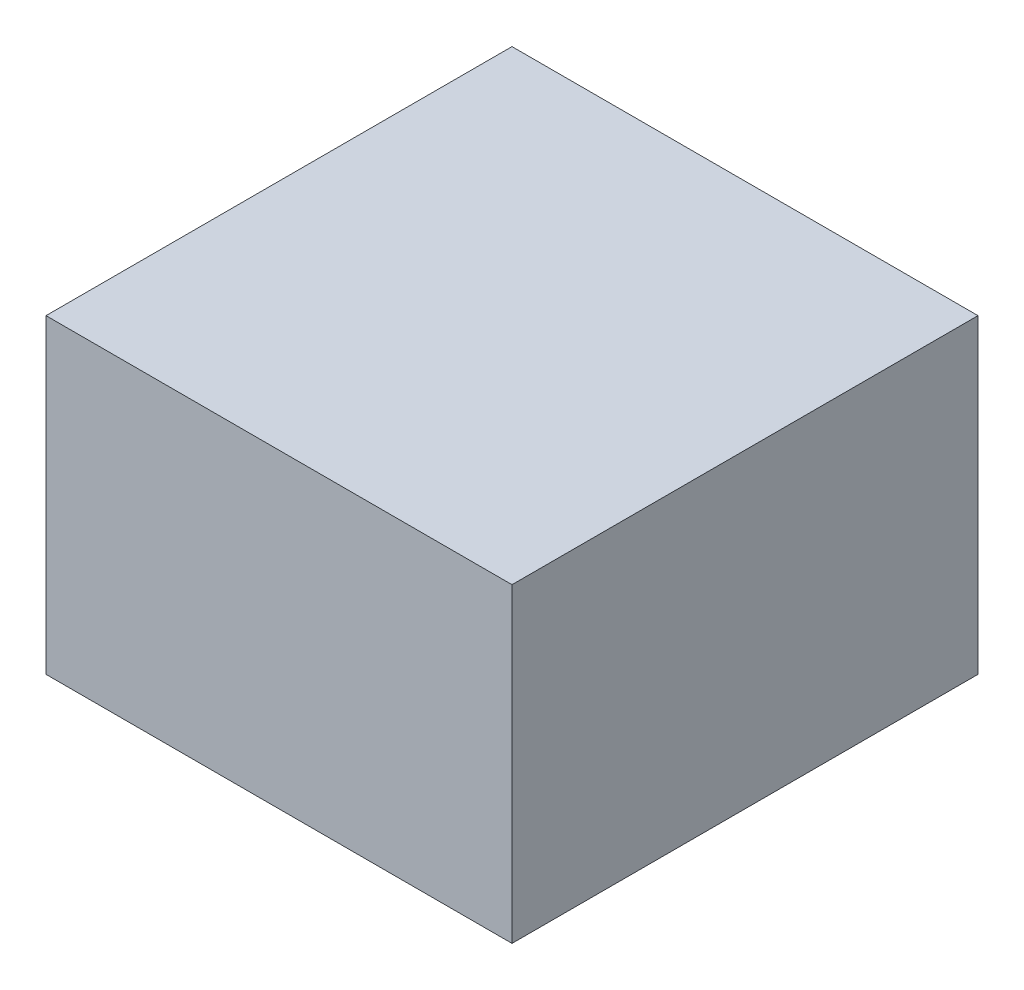
ISO-10303-21;
HEADER;
FILE_DESCRIPTION(('STEP AP214'),'2;1');
FILE_NAME('part.step','',(''),(''),'','','');
FILE_SCHEMA(('AUTOMOTIVE_DESIGN { 1 0 10303 214 1 1 1 1 }'));
ENDSEC;
DATA;
#1=APPLICATION_CONTEXT('core data for automotive mechanical design processes');
#2=APPLICATION_PROTOCOL_DEFINITION('international standard','automotive_design',2000,#1);
#3=PRODUCT_CONTEXT('',#1,'mechanical');
#4=PRODUCT('Part','Part','',(#3));
#5=PRODUCT_RELATED_PRODUCT_CATEGORY('part','',(#4));
#6=PRODUCT_DEFINITION_FORMATION('','',#4);
#7=PRODUCT_DEFINITION_CONTEXT('part definition',#1,'design');
#8=PRODUCT_DEFINITION('design','',#6,#7);
#9=PRODUCT_DEFINITION_SHAPE('','',#8);
#10=(LENGTH_UNIT() NAMED_UNIT(*) SI_UNIT(.MILLI.,.METRE.));
#11=(NAMED_UNIT(*) PLANE_ANGLE_UNIT() SI_UNIT($,.RADIAN.));
#12=(NAMED_UNIT(*) SI_UNIT($,.STERADIAN.) SOLID_ANGLE_UNIT());
#13=UNCERTAINTY_MEASURE_WITH_UNIT(LENGTH_MEASURE(1.E-05),#10,'distance_accuracy_value','');
#14=(GEOMETRIC_REPRESENTATION_CONTEXT(3) GLOBAL_UNCERTAINTY_ASSIGNED_CONTEXT((#13)) GLOBAL_UNIT_ASSIGNED_CONTEXT((#10,
#11,#12)) REPRESENTATION_CONTEXT('',''));
#15=CARTESIAN_POINT('',(0.,0.,0.));
#16=DIRECTION('',(0.,0.,1.));
#17=DIRECTION('',(1.,0.,0.));
#18=AXIS2_PLACEMENT_3D('',#15,#16,#17);
#19=CARTESIAN_POINT('',(76.2,50.8,76.2));
#20=DIRECTION('',(-1.,0.,0.));
#21=DIRECTION('',(0.,0.,1.));
#22=AXIS2_PLACEMENT_3D('',#19,#20,#21);
#23=PLANE('',#22);
#24=DIRECTION('',(0.,0.,-1.));
#25=VECTOR('',#24,1.);
#26=CARTESIAN_POINT('',(76.2,-50.8,76.2));
#27=LINE('',#26,#25);
#28=CARTESIAN_POINT('',(76.2,-50.8,76.2));
#29=VERTEX_POINT('',#28);
#30=CARTESIAN_POINT('',(76.2,-50.8,-76.2));
#31=VERTEX_POINT('',#30);
#32=EDGE_CURVE('E93',#29,#31,#27,.T.);
#33=ORIENTED_EDGE('',*,*,#32,.T.);
#34=DIRECTION('',(0.,-1.,0.));
#35=VECTOR('',#34,1.);
#36=CARTESIAN_POINT('',(76.2,50.8,-76.2));
#37=LINE('',#36,#35);
#38=CARTESIAN_POINT('',(76.2,50.8,-76.2));
#39=VERTEX_POINT('',#38);
#40=EDGE_CURVE('E11',#39,#31,#37,.T.);
#41=ORIENTED_EDGE('',*,*,#40,.F.);
#42=DIRECTION('',(0.,0.,-1.));
#43=VECTOR('',#42,1.);
#44=CARTESIAN_POINT('',(76.2,50.8,76.2));
#45=LINE('',#44,#43);
#46=CARTESIAN_POINT('',(76.2,50.8,76.2));
#47=VERTEX_POINT('',#46);
#48=EDGE_CURVE('E81',#47,#39,#45,.T.);
#49=ORIENTED_EDGE('',*,*,#48,.F.);
#50=DIRECTION('',(0.,-1.,0.));
#51=VECTOR('',#50,1.);
#52=CARTESIAN_POINT('',(76.2,50.8,76.2));
#53=LINE('',#52,#51);
#54=EDGE_CURVE('E89',#47,#29,#53,.T.);
#55=ORIENTED_EDGE('',*,*,#54,.T.);
#56=EDGE_LOOP('',(#33,#41,#49,#55));
#57=FACE_BOUND('',#56,.T.);
#58=ADVANCED_FACE('F30',(#57),#23,.F.);
#59=CARTESIAN_POINT('',(-76.2,50.8,-76.2));
#60=DIRECTION('',(0.,0.,1.));
#61=DIRECTION('',(1.,0.,0.));
#62=AXIS2_PLACEMENT_3D('',#59,#60,#61);
#63=PLANE('',#62);
#64=DIRECTION('',(-1.,0.,0.));
#65=VECTOR('',#64,1.);
#66=CARTESIAN_POINT('',(-76.2,-50.8,-76.2));
#67=LINE('',#66,#65);
#68=CARTESIAN_POINT('',(-76.2,-50.8,-76.2));
#69=VERTEX_POINT('',#68);
#70=EDGE_CURVE('E85',#31,#69,#67,.T.);
#71=ORIENTED_EDGE('',*,*,#70,.T.);
#72=DIRECTION('',(0.,-1.,0.));
#73=VECTOR('',#72,1.);
#74=CARTESIAN_POINT('',(-76.2,50.8,-76.2));
#75=LINE('',#74,#73);
#76=CARTESIAN_POINT('',(-76.2,50.8,-76.2));
#77=VERTEX_POINT('',#76);
#78=EDGE_CURVE('E38',#77,#69,#75,.T.);
#79=ORIENTED_EDGE('',*,*,#78,.F.);
#80=DIRECTION('',(-1.,0.,0.));
#81=VECTOR('',#80,1.);
#82=CARTESIAN_POINT('',(-76.2,50.8,-76.2));
#83=LINE('',#82,#81);
#84=EDGE_CURVE('E76',#39,#77,#83,.T.);
#85=ORIENTED_EDGE('',*,*,#84,.F.);
#86=ORIENTED_EDGE('',*,*,#40,.T.);
#87=EDGE_LOOP('',(#71,#79,#85,#86));
#88=FACE_BOUND('',#87,.T.);
#89=ADVANCED_FACE('F84',(#88),#63,.F.);
#90=CARTESIAN_POINT('',(-76.2,50.8,76.2));
#91=DIRECTION('',(1.,0.,0.));
#92=DIRECTION('',(0.,0.,-1.));
#93=AXIS2_PLACEMENT_3D('',#90,#91,#92);
#94=PLANE('',#93);
#95=DIRECTION('',(0.,0.,1.));
#96=VECTOR('',#95,1.);
#97=CARTESIAN_POINT('',(-76.2,-50.8,76.2));
#98=LINE('',#97,#96);
#99=CARTESIAN_POINT('',(-76.2,-50.8,76.2));
#100=VERTEX_POINT('',#99);
#101=EDGE_CURVE('E63',#69,#100,#98,.T.);
#102=ORIENTED_EDGE('',*,*,#101,.T.);
#103=DIRECTION('',(0.,-1.,0.));
#104=VECTOR('',#103,1.);
#105=CARTESIAN_POINT('',(-76.2,50.8,76.2));
#106=LINE('',#105,#104);
#107=CARTESIAN_POINT('',(-76.2,50.8,76.2));
#108=VERTEX_POINT('',#107);
#109=EDGE_CURVE('E86',#108,#100,#106,.T.);
#110=ORIENTED_EDGE('',*,*,#109,.F.);
#111=DIRECTION('',(0.,0.,1.));
#112=VECTOR('',#111,1.);
#113=CARTESIAN_POINT('',(-76.2,50.8,76.2));
#114=LINE('',#113,#112);
#115=EDGE_CURVE('E79',#77,#108,#114,.T.);
#116=ORIENTED_EDGE('',*,*,#115,.F.);
#117=ORIENTED_EDGE('',*,*,#78,.T.);
#118=EDGE_LOOP('',(#102,#110,#116,#117));
#119=FACE_BOUND('',#118,.T.);
#120=ADVANCED_FACE('F87',(#119),#94,.F.);
#121=CARTESIAN_POINT('',(-76.2,50.8,76.2));
#122=DIRECTION('',(0.,0.,-1.));
#123=DIRECTION('',(-1.,0.,0.));
#124=AXIS2_PLACEMENT_3D('',#121,#122,#123);
#125=PLANE('',#124);
#126=DIRECTION('',(1.,0.,0.));
#127=VECTOR('',#126,1.);
#128=CARTESIAN_POINT('',(-76.2,-50.8,76.2));
#129=LINE('',#128,#127);
#130=EDGE_CURVE('E69',#100,#29,#129,.T.);
#131=ORIENTED_EDGE('',*,*,#130,.T.);
#132=ORIENTED_EDGE('',*,*,#54,.F.);
#133=DIRECTION('',(1.,0.,0.));
#134=VECTOR('',#133,1.);
#135=CARTESIAN_POINT('',(-76.2,50.8,76.2));
#136=LINE('',#135,#134);
#137=EDGE_CURVE('E46',#108,#47,#136,.T.);
#138=ORIENTED_EDGE('',*,*,#137,.F.);
#139=ORIENTED_EDGE('',*,*,#109,.T.);
#140=EDGE_LOOP('',(#131,#132,#138,#139));
#141=FACE_BOUND('',#140,.T.);
#142=ADVANCED_FACE('F100',(#141),#125,.F.);
#143=CARTESIAN_POINT('',(76.1999999999999,50.8,-76.2));
#144=DIRECTION('',(0.,-1.,0.));
#145=DIRECTION('',(0.,0.,-1.));
#146=AXIS2_PLACEMENT_3D('',#143,#144,#145);
#147=PLANE('',#146);
#148=ORIENTED_EDGE('',*,*,#48,.T.);
#149=ORIENTED_EDGE('',*,*,#84,.T.);
#150=ORIENTED_EDGE('',*,*,#115,.T.);
#151=ORIENTED_EDGE('',*,*,#137,.T.);
#152=EDGE_LOOP('',(#148,#149,#150,#151));
#153=FACE_BOUND('',#152,.T.);
#154=ADVANCED_FACE('F77',(#153),#147,.F.);
#155=CARTESIAN_POINT('',(76.1999999999999,-50.8,-76.2));
#156=DIRECTION('',(0.,-1.,0.));
#157=DIRECTION('',(0.,0.,-1.));
#158=AXIS2_PLACEMENT_3D('',#155,#156,#157);
#159=PLANE('',#158);
#160=ORIENTED_EDGE('',*,*,#32,.F.);
#161=ORIENTED_EDGE('',*,*,#130,.F.);
#162=ORIENTED_EDGE('',*,*,#101,.F.);
#163=ORIENTED_EDGE('',*,*,#70,.F.);
#164=EDGE_LOOP('',(#160,#161,#162,#163));
#165=FACE_BOUND('',#164,.T.);
#166=ADVANCED_FACE('F103',(#165),#159,.T.);
#167=CLOSED_SHELL('',(#58,#89,#120,#142,#154,#166));
#168=MANIFOLD_SOLID_BREP('B2',#167);
#169=ADVANCED_BREP_SHAPE_REPRESENTATION('',(#18,#168),#14);
#170=SHAPE_DEFINITION_REPRESENTATION(#9,#169);
ENDSEC;
END-ISO-10303-21;
